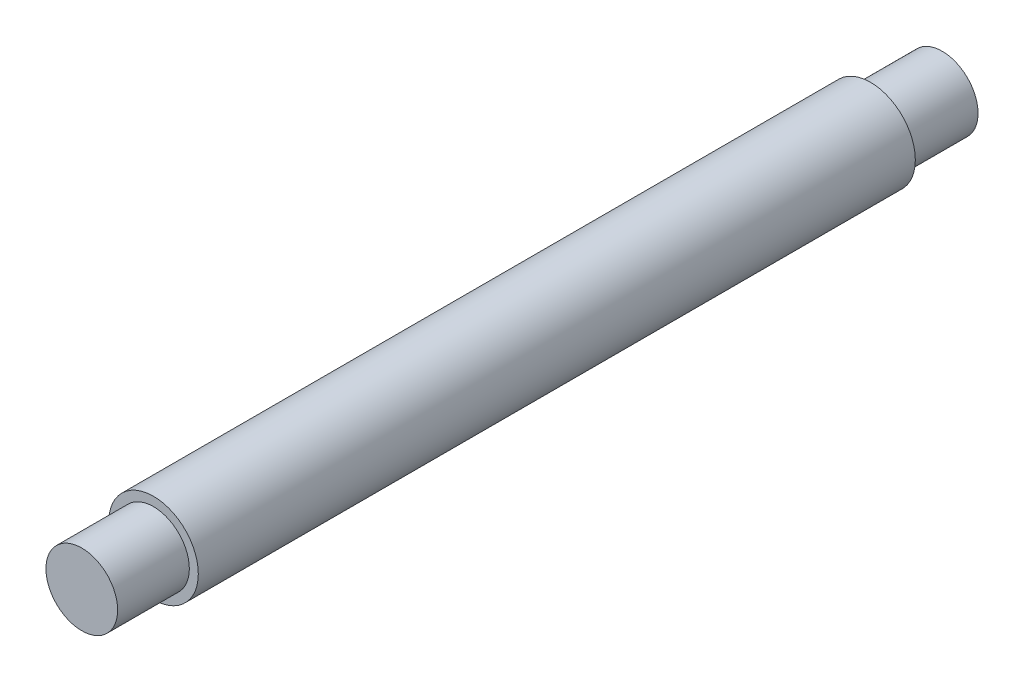
ISO-10303-21;
HEADER;
FILE_DESCRIPTION(('STEP AP214'),'2;1');
FILE_NAME('part.step','',(''),(''),'','','');
FILE_SCHEMA(('AUTOMOTIVE_DESIGN { 1 0 10303 214 1 1 1 1 }'));
ENDSEC;
DATA;
#1=APPLICATION_CONTEXT('core data for automotive mechanical design processes');
#2=APPLICATION_PROTOCOL_DEFINITION('international standard','automotive_design',2000,#1);
#3=PRODUCT_CONTEXT('',#1,'mechanical');
#4=PRODUCT('Part','Part','',(#3));
#5=PRODUCT_RELATED_PRODUCT_CATEGORY('part','',(#4));
#6=PRODUCT_DEFINITION_FORMATION('','',#4);
#7=PRODUCT_DEFINITION_CONTEXT('part definition',#1,'design');
#8=PRODUCT_DEFINITION('design','',#6,#7);
#9=PRODUCT_DEFINITION_SHAPE('','',#8);
#10=(LENGTH_UNIT() NAMED_UNIT(*) SI_UNIT(.MILLI.,.METRE.));
#11=(NAMED_UNIT(*) PLANE_ANGLE_UNIT() SI_UNIT($,.RADIAN.));
#12=(NAMED_UNIT(*) SI_UNIT($,.STERADIAN.) SOLID_ANGLE_UNIT());
#13=UNCERTAINTY_MEASURE_WITH_UNIT(LENGTH_MEASURE(1.E-05),#10,'distance_accuracy_value','');
#14=(GEOMETRIC_REPRESENTATION_CONTEXT(3) GLOBAL_UNCERTAINTY_ASSIGNED_CONTEXT((#13)) GLOBAL_UNIT_ASSIGNED_CONTEXT((#10,
#11,#12)) REPRESENTATION_CONTEXT('',''));
#15=CARTESIAN_POINT('',(0.,0.,0.));
#16=DIRECTION('',(0.,0.,1.));
#17=DIRECTION('',(1.,0.,0.));
#18=AXIS2_PLACEMENT_3D('',#15,#16,#17);
#19=CARTESIAN_POINT('',(-5.49342359008525,5.70470911278084,101.6));
#20=DIRECTION('',(0.,0.,-1.));
#21=DIRECTION('',(-1.,0.,0.));
#22=AXIS2_PLACEMENT_3D('',#19,#20,#21);
#23=CYLINDRICAL_SURFACE('',#22,6.35);
#24=CARTESIAN_POINT('',(-5.49342359008525,5.70470911278084,101.6));
#25=DIRECTION('',(0.,0.,1.));
#26=DIRECTION('',(1.,0.,0.));
#27=AXIS2_PLACEMENT_3D('',#24,#25,#26);
#28=CIRCLE('',#27,6.35);
#29=CARTESIAN_POINT('',(0.856576409914754,5.70470911278084,101.6));
#30=VERTEX_POINT('',#29);
#31=EDGE_CURVE('E51',#30,#30,#28,.T.);
#32=ORIENTED_EDGE('',*,*,#31,.F.);
#33=EDGE_LOOP('',(#32));
#34=FACE_BOUND('',#33,.T.);
#35=CARTESIAN_POINT('',(-5.49342359008525,5.70470911278084,0.));
#36=DIRECTION('',(0.,0.,1.));
#37=DIRECTION('',(1.,0.,0.));
#38=AXIS2_PLACEMENT_3D('',#35,#36,#37);
#39=CIRCLE('',#38,6.35);
#40=CARTESIAN_POINT('',(0.856576409914754,5.70470911278084,0.));
#41=VERTEX_POINT('',#40);
#42=EDGE_CURVE('E40',#41,#41,#39,.T.);
#43=ORIENTED_EDGE('',*,*,#42,.T.);
#44=EDGE_LOOP('',(#43));
#45=FACE_BOUND('',#44,.T.);
#46=ADVANCED_FACE('F37',(#34,#45),#23,.T.);
#47=CARTESIAN_POINT('',(-5.49342359008525,5.70470911278084,101.6));
#48=DIRECTION('',(0.,0.,1.));
#49=DIRECTION('',(1.,0.,0.));
#50=AXIS2_PLACEMENT_3D('',#47,#48,#49);
#51=PLANE('',#50);
#52=CARTESIAN_POINT('',(-5.49342359008525,5.70470911278084,101.6));
#53=DIRECTION('',(0.,0.,1.));
#54=DIRECTION('',(1.,0.,0.));
#55=AXIS2_PLACEMENT_3D('',#52,#53,#54);
#56=CIRCLE('',#55,5.08);
#57=CARTESIAN_POINT('',(-0.413423590085246,5.70470911278084,101.6));
#58=VERTEX_POINT('',#57);
#59=EDGE_CURVE('E45',#58,#58,#56,.T.);
#60=ORIENTED_EDGE('',*,*,#59,.F.);
#61=EDGE_LOOP('',(#60));
#62=FACE_BOUND('',#61,.T.);
#63=ORIENTED_EDGE('',*,*,#31,.T.);
#64=EDGE_LOOP('',(#63));
#65=FACE_BOUND('',#64,.T.);
#66=ADVANCED_FACE('F71',(#62,#65),#51,.T.);
#67=CARTESIAN_POINT('',(-5.49342359008525,5.70470911278084,0.));
#68=DIRECTION('',(0.,0.,1.));
#69=DIRECTION('',(1.,0.,0.));
#70=AXIS2_PLACEMENT_3D('',#67,#68,#69);
#71=PLANE('',#70);
#72=CARTESIAN_POINT('',(-5.49342359008525,5.70470911278084,0.));
#73=DIRECTION('',(0.,0.,-1.));
#74=DIRECTION('',(-1.,0.,0.));
#75=AXIS2_PLACEMENT_3D('',#72,#73,#74);
#76=CIRCLE('',#75,5.08);
#77=CARTESIAN_POINT('',(-10.5734235900852,5.70470911278084,0.));
#78=VERTEX_POINT('',#77);
#79=EDGE_CURVE('E10',#78,#78,#76,.T.);
#80=ORIENTED_EDGE('',*,*,#79,.F.);
#81=EDGE_LOOP('',(#80));
#82=FACE_BOUND('',#81,.T.);
#83=ORIENTED_EDGE('',*,*,#42,.F.);
#84=EDGE_LOOP('',(#83));
#85=FACE_BOUND('',#84,.T.);
#86=ADVANCED_FACE('F68',(#82,#85),#71,.F.);
#87=CARTESIAN_POINT('',(-5.49342359008525,5.70470911278084,111.76));
#88=DIRECTION('',(0.,0.,-1.));
#89=DIRECTION('',(-1.,0.,0.));
#90=AXIS2_PLACEMENT_3D('',#87,#88,#89);
#91=CYLINDRICAL_SURFACE('',#90,5.08);
#92=CARTESIAN_POINT('',(-5.49342359008525,5.70470911278084,111.76));
#93=DIRECTION('',(0.,0.,1.));
#94=DIRECTION('',(1.,0.,0.));
#95=AXIS2_PLACEMENT_3D('',#92,#93,#94);
#96=CIRCLE('',#95,5.08);
#97=CARTESIAN_POINT('',(-0.413423590085246,5.70470911278084,111.76));
#98=VERTEX_POINT('',#97);
#99=EDGE_CURVE('E56',#98,#98,#96,.T.);
#100=ORIENTED_EDGE('',*,*,#99,.F.);
#101=EDGE_LOOP('',(#100));
#102=FACE_BOUND('',#101,.T.);
#103=ORIENTED_EDGE('',*,*,#59,.T.);
#104=EDGE_LOOP('',(#103));
#105=FACE_BOUND('',#104,.T.);
#106=ADVANCED_FACE('F70',(#102,#105),#91,.T.);
#107=CARTESIAN_POINT('',(-5.49342359008525,5.70470911278084,111.76));
#108=DIRECTION('',(0.,0.,1.));
#109=DIRECTION('',(1.,0.,0.));
#110=AXIS2_PLACEMENT_3D('',#107,#108,#109);
#111=PLANE('',#110);
#112=ORIENTED_EDGE('',*,*,#99,.T.);
#113=EDGE_LOOP('',(#112));
#114=FACE_BOUND('',#113,.T.);
#115=ADVANCED_FACE('F77',(#114),#111,.T.);
#116=CARTESIAN_POINT('',(-5.49342359008525,5.70470911278084,-10.16));
#117=DIRECTION('',(0.,0.,1.));
#118=DIRECTION('',(1.,0.,0.));
#119=AXIS2_PLACEMENT_3D('',#116,#117,#118);
#120=CYLINDRICAL_SURFACE('',#119,5.08);
#121=CARTESIAN_POINT('',(-5.49342359008525,5.70470911278084,-10.16));
#122=DIRECTION('',(0.,0.,-1.));
#123=DIRECTION('',(-1.,0.,0.));
#124=AXIS2_PLACEMENT_3D('',#121,#122,#123);
#125=CIRCLE('',#124,5.08);
#126=CARTESIAN_POINT('',(-10.5734235900852,5.70470911278084,-10.16));
#127=VERTEX_POINT('',#126);
#128=EDGE_CURVE('E55',#127,#127,#125,.T.);
#129=ORIENTED_EDGE('',*,*,#128,.F.);
#130=EDGE_LOOP('',(#129));
#131=FACE_BOUND('',#130,.T.);
#132=ORIENTED_EDGE('',*,*,#79,.T.);
#133=EDGE_LOOP('',(#132));
#134=FACE_BOUND('',#133,.T.);
#135=ADVANCED_FACE('F105',(#131,#134),#120,.T.);
#136=CARTESIAN_POINT('',(-5.49342359008525,5.70470911278084,-10.16));
#137=DIRECTION('',(0.,0.,-1.));
#138=DIRECTION('',(-1.,0.,0.));
#139=AXIS2_PLACEMENT_3D('',#136,#137,#138);
#140=PLANE('',#139);
#141=ORIENTED_EDGE('',*,*,#128,.T.);
#142=EDGE_LOOP('',(#141));
#143=FACE_BOUND('',#142,.T.);
#144=ADVANCED_FACE('F119',(#143),#140,.T.);
#145=CLOSED_SHELL('',(#46,#66,#86,#106,#115,#135,#144));
#146=MANIFOLD_SOLID_BREP('B2',#145);
#147=ADVANCED_BREP_SHAPE_REPRESENTATION('',(#18,#146),#14);
#148=SHAPE_DEFINITION_REPRESENTATION(#9,#147);
ENDSEC;
END-ISO-10303-21;
